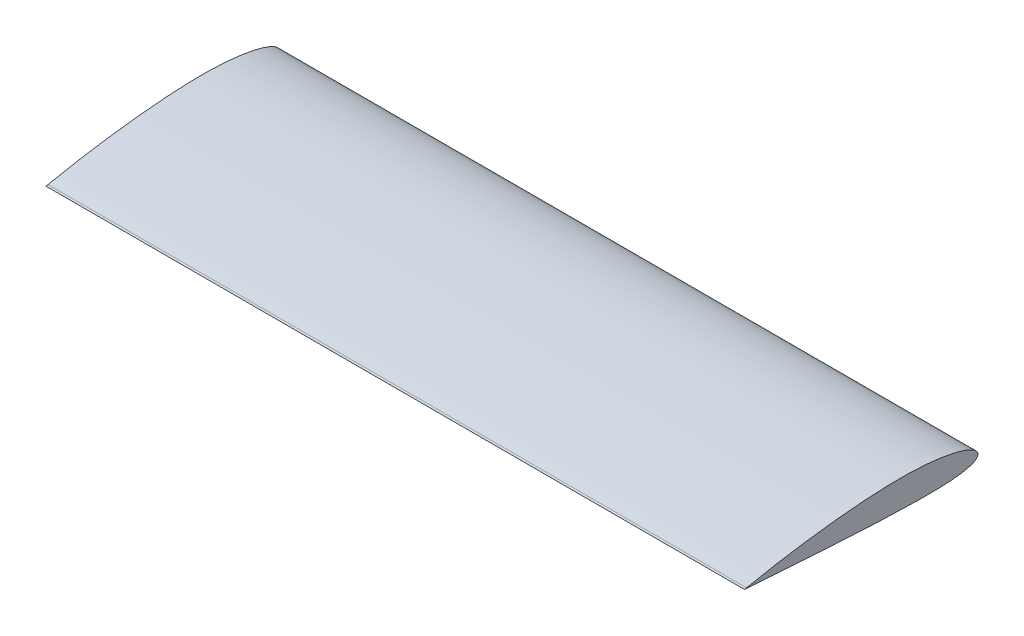
ISO-10303-21;
HEADER;
FILE_DESCRIPTION(('STEP AP214'),'2;1');
FILE_NAME('part.step','',(''),(''),'','','');
FILE_SCHEMA(('AUTOMOTIVE_DESIGN { 1 0 10303 214 1 1 1 1 }'));
ENDSEC;
DATA;
#1=APPLICATION_CONTEXT('core data for automotive mechanical design processes');
#2=APPLICATION_PROTOCOL_DEFINITION('international standard','automotive_design',2000,#1);
#3=PRODUCT_CONTEXT('',#1,'mechanical');
#4=PRODUCT('Part','Part','',(#3));
#5=PRODUCT_RELATED_PRODUCT_CATEGORY('part','',(#4));
#6=PRODUCT_DEFINITION_FORMATION('','',#4);
#7=PRODUCT_DEFINITION_CONTEXT('part definition',#1,'design');
#8=PRODUCT_DEFINITION('design','',#6,#7);
#9=PRODUCT_DEFINITION_SHAPE('','',#8);
#10=(LENGTH_UNIT() NAMED_UNIT(*) SI_UNIT(.MILLI.,.METRE.));
#11=(NAMED_UNIT(*) PLANE_ANGLE_UNIT() SI_UNIT($,.RADIAN.));
#12=(NAMED_UNIT(*) SI_UNIT($,.STERADIAN.) SOLID_ANGLE_UNIT());
#13=UNCERTAINTY_MEASURE_WITH_UNIT(LENGTH_MEASURE(1.E-05),#10,'distance_accuracy_value','');
#14=(GEOMETRIC_REPRESENTATION_CONTEXT(3) GLOBAL_UNCERTAINTY_ASSIGNED_CONTEXT((#13)) GLOBAL_UNIT_ASSIGNED_CONTEXT((#10,
#11,#12)) REPRESENTATION_CONTEXT('',''));
#15=CARTESIAN_POINT('',(0.,0.,0.));
#16=DIRECTION('',(0.,0.,1.));
#17=DIRECTION('',(1.,0.,0.));
#18=AXIS2_PLACEMENT_3D('',#15,#16,#17);
#19=CARTESIAN_POINT('',(400.,-0.333105,264.97774));
#20=CARTESIAN_POINT('',(400.,-0.343086398439484,264.840381647581));
#21=CARTESIAN_POINT('',(400.,-0.382954061590913,264.291745446105));
#22=CARTESIAN_POINT('',(400.,-0.472447332258964,263.060588227852));
#23=CARTESIAN_POINT('',(400.,-0.619491603057295,261.017524089221));
#24=CARTESIAN_POINT('',(400.,-0.823254103332756,258.175971421427));
#25=CARTESIAN_POINT('',(400.,-1.08035983504779,254.554402567837));
#26=CARTESIAN_POINT('',(400.,-1.38873604157051,250.176374286789));
#27=CARTESIAN_POINT('',(400.,-1.74457803952383,245.070197097375));
#28=CARTESIAN_POINT('',(400.,-2.14448461237748,239.268728847541));
#29=CARTESIAN_POINT('',(400.,-2.5855760887511,232.809108357549));
#30=CARTESIAN_POINT('',(400.,-3.06363750042959,225.732617470253));
#31=CARTESIAN_POINT('',(400.,-3.57628691586201,218.08421906913));
#32=CARTESIAN_POINT('',(400.,-4.11840500560355,209.912313524899));
#33=CARTESIAN_POINT('',(400.,-4.68710830231964,201.268312633106));
#34=CARTESIAN_POINT('',(400.,-5.27716928180779,192.206498450347));
#35=CARTESIAN_POINT('',(400.,-5.88359412654541,182.783440417792));
#36=CARTESIAN_POINT('',(400.,-6.49988718754895,173.057713444675));
#37=CARTESIAN_POINT('',(400.,-7.11737459374632,163.089417583912));
#38=CARTESIAN_POINT('',(400.,-7.7281453660474,152.940024856377));
#39=CARTESIAN_POINT('',(400.,-8.32027508678526,142.671807574428));
#40=CARTESIAN_POINT('',(400.,-8.88299758938067,132.347464274168));
#41=CARTESIAN_POINT('',(400.,-9.40032389772018,122.029645296017));
#42=CARTESIAN_POINT('',(400.,-9.86098005029763,111.792756576857));
#43=CARTESIAN_POINT('',(400.,-10.2419084070734,101.713695699793));
#44=CARTESIAN_POINT('',(400.,-10.5897344976678,91.8544705413589));
#45=CARTESIAN_POINT('',(400.,-10.8801771942521,82.2599682068506));
#46=CARTESIAN_POINT('',(400.,-11.0979325902701,72.969697841113));
#47=CARTESIAN_POINT('',(400.,-11.2241010109014,64.036529176303));
#48=CARTESIAN_POINT('',(400.,-11.2433112582234,55.5113403962553));
#49=CARTESIAN_POINT('',(400.,-11.1403210932851,47.442938193976));
#50=CARTESIAN_POINT('',(400.,-10.9039511396428,39.8777778541888));
#51=CARTESIAN_POINT('',(400.,-10.5243541578148,32.8599574526275));
#52=CARTESIAN_POINT('',(400.,-9.99547629959962,26.430792204349));
#53=CARTESIAN_POINT('',(400.,-9.31285336830411,20.6286265865943));
#54=CARTESIAN_POINT('',(400.,-8.47538916462038,15.4882661550534));
#55=CARTESIAN_POINT('',(400.,-7.48383595514868,11.0399606438756));
#56=CARTESIAN_POINT('',(400.,-6.34071510158632,7.30803135455585));
#57=CARTESIAN_POINT('',(400.,-5.0447380819559,4.30810264299736));
#58=CARTESIAN_POINT('',(400.,-3.58928961311949,2.04519397034396));
#59=CARTESIAN_POINT('',(400.,-1.9270787651214,0.520044605673095));
#60=CARTESIAN_POINT('',(400.,-0.015132606937662,-0.151086197310095));
#61=CARTESIAN_POINT('',(400.,1.99369453815204,0.12866351689015));
#62=CARTESIAN_POINT('',(400.,3.92547996049618,1.30692101404902));
#63=CARTESIAN_POINT('',(400.,5.79370516037481,3.26474907590773));
#64=CARTESIAN_POINT('',(400.,7.6355176023044,6.00088538468052));
#65=CARTESIAN_POINT('',(400.,9.44707375809193,9.51377246260984));
#66=CARTESIAN_POINT('',(400.,11.2103918098742,13.794651418626));
#67=CARTESIAN_POINT('',(400.,12.9020007520039,18.8235611140945));
#68=CARTESIAN_POINT('',(400.,14.4950294512341,24.5739152595655));
#69=CARTESIAN_POINT('',(400.,15.9648751202824,31.0116820652048));
#70=CARTESIAN_POINT('',(400.,17.2851916032288,38.0979977685286));
#71=CARTESIAN_POINT('',(400.,18.4335908906827,45.7880268577529));
#72=CARTESIAN_POINT('',(400.,19.3897528805995,54.0324642520899));
#73=CARTESIAN_POINT('',(400.,20.1376284632721,62.77743029114));
#74=CARTESIAN_POINT('',(400.,20.6640622359932,71.9655504369099));
#75=CARTESIAN_POINT('',(400.,20.9612263954031,81.5360467910961));
#76=CARTESIAN_POINT('',(400.,21.0255218281817,91.4256556207248));
#77=CARTESIAN_POINT('',(400.,20.8584306033123,101.553936183397));
#78=CARTESIAN_POINT('',(400.,20.4612710614624,111.842174889108));
#79=CARTESIAN_POINT('',(400.,19.9070899485495,122.22699254535));
#80=CARTESIAN_POINT('',(400.,19.2030866162824,132.658565599283));
#81=CARTESIAN_POINT('',(400.,18.3659116600995,143.083389013939));
#82=CARTESIAN_POINT('',(400.,17.4092482431578,153.436223744034));
#83=CARTESIAN_POINT('',(400.,16.3524050329091,163.652758488645));
#84=CARTESIAN_POINT('',(400.,15.2107450277969,173.669610490618));
#85=CARTESIAN_POINT('',(400.,14.0042483036042,183.425101928762));
#86=CARTESIAN_POINT('',(400.,12.7501718959421,192.859315617433));
#87=CARTESIAN_POINT('',(400.,11.4670714452023,201.914571502478));
#88=CARTESIAN_POINT('',(400.,10.174181336886,210.535821315948));
#89=CARTESIAN_POINT('',(400.,8.89006976354393,218.670630041925));
#90=CARTESIAN_POINT('',(400.,7.63362981541927,226.26995729515));
#91=CARTESIAN_POINT('',(400.,6.42419688318019,233.288212254772));
#92=CARTESIAN_POINT('',(400.,5.28007664225557,239.683580204607));
#93=CARTESIAN_POINT('',(400.,4.21908710505265,245.417849168806));
#94=CARTESIAN_POINT('',(400.,3.25928961884847,250.457262183279));
#95=CARTESIAN_POINT('',(400.,2.41628190967542,254.772148360217));
#96=CARTESIAN_POINT('',(400.,1.70460781413092,258.337172417303));
#97=CARTESIAN_POINT('',(400.,1.13752635519061,261.131749999981));
#98=CARTESIAN_POINT('',(400.,0.724422493665584,263.139373936522));
#99=CARTESIAN_POINT('',(400.,0.473436401806954,264.348608843345));
#100=CARTESIAN_POINT('',(400.,0.361203166653233,264.887376700738));
#101=CARTESIAN_POINT('',(400.,0.333105,265.02226));
#102=B_SPLINE_CURVE_WITH_KNOTS('',3,(#19,#20,#21,#22,#23,#24,#25,#26,#27,#28,#29,#30,#31,#32,
#33,#34,#35,#36,#37,#38,#39,#40,#41,#42,#43,#44,#45,#46,#47,#48,#49,#50,#51,#52,#53,#54,#55,#56,
#57,#58,#59,#60,#61,#62,#63,#64,#65,#66,#67,#68,#69,#70,#71,#72,#73,#74,#75,#76,#77,#78,#79,#80,
#81,#82,#83,#84,#85,#86,#87,#88,#89,#90,#91,#92,#93,#94,#95,#96,#97,#98,#99,#100,#101),
.UNSPECIFIED.,.F.,.F.,(4,1,1,1,1,1,1,1,1,1,1,1,1,1,1,1,1,1,1,1,1,1,1,1,1,1,1,1,1,1,1,1,1,1,1,1,
1,1,1,1,1,1,1,1,1,1,1,1,1,1,1,1,1,1,1,1,1,1,1,1,1,1,1,1,1,1,1,1,1,1,1,1,1,1,1,1,1,1,1,1,4),(0.,
0.000763849001500838,0.00305096273583516,0.0068464695522461,0.0121247484862886,
0.0188517323013395,0.0269835822459313,0.036467072952227,0.0472411623624427,0.059237023749269,
0.072377943954829,0.0865794557279205,0.101753050357609,0.117801975084679,0.134625927408029,
0.15211965624753,0.170173849863638,0.188676584211923,0.207513463209848,0.226567927798734,
0.245722459831779,0.264860936987902,0.283866077458523,0.302557043653414,0.320802791746689,
0.338582940766319,0.355795759860566,0.372343677759343,0.388133630608251,0.403078328240631,
0.417095611775281,0.430110357882856,0.442054549095498,0.452868818715277,0.462505009146628,
0.470928785019175,0.478127761278921,0.484123875338212,0.488999972182062,0.492959403174825,
0.496412777697822,0.499866609506216,0.50383217608047,0.508732461778435,0.51477966167091,
0.522066384116654,0.530620554720803,0.540434572011856,0.551477175550533,0.563701851231184,
0.577048547245343,0.591447280896427,0.606818147252312,0.623074182281721,0.640120289431202,
0.657856183183399,0.676175563379063,0.694967819833854,0.714033957187982,0.733277175195403,
0.752646098718606,0.772021105338392,0.7912817902148,0.810310109979621,0.828987081513378,
0.847197702829786,0.864829110746378,0.881772296963255,0.897922602456206,0.913179947694549,
0.927449194878037,0.940643128994877,0.952679251989813,0.963483187916785,0.972987160696187,
0.981132008479951,0.987867526601434,0.993150194295179,0.996947646215246,0.999235827558466,1.),.UNSPECIFIED.);
#103=DIRECTION('',(-1.,0.,0.));
#104=VECTOR('',#103,1.);
#105=SURFACE_OF_LINEAR_EXTRUSION('',#102,#104);
#106=CARTESIAN_POINT('',(-400.,-0.333105,264.97774));
#107=CARTESIAN_POINT('',(-400.,-0.343086398439484,264.840381647581));
#108=CARTESIAN_POINT('',(-400.,-0.382954061590913,264.291745446105));
#109=CARTESIAN_POINT('',(-400.,-0.472447332258964,263.060588227852));
#110=CARTESIAN_POINT('',(-400.,-0.619491603057295,261.017524089221));
#111=CARTESIAN_POINT('',(-400.,-0.823254103332756,258.175971421427));
#112=CARTESIAN_POINT('',(-400.,-1.08035983504779,254.554402567837));
#113=CARTESIAN_POINT('',(-400.,-1.38873604157051,250.176374286789));
#114=CARTESIAN_POINT('',(-400.,-1.74457803952383,245.070197097375));
#115=CARTESIAN_POINT('',(-400.,-2.14448461237748,239.268728847541));
#116=CARTESIAN_POINT('',(-400.,-2.5855760887511,232.809108357549));
#117=CARTESIAN_POINT('',(-400.,-3.06363750042959,225.732617470253));
#118=CARTESIAN_POINT('',(-400.,-3.57628691586201,218.08421906913));
#119=CARTESIAN_POINT('',(-400.,-4.11840500560355,209.912313524899));
#120=CARTESIAN_POINT('',(-400.,-4.68710830231964,201.268312633106));
#121=CARTESIAN_POINT('',(-400.,-5.27716928180779,192.206498450347));
#122=CARTESIAN_POINT('',(-400.,-5.88359412654541,182.783440417792));
#123=CARTESIAN_POINT('',(-400.,-6.49988718754895,173.057713444675));
#124=CARTESIAN_POINT('',(-400.,-7.11737459374632,163.089417583912));
#125=CARTESIAN_POINT('',(-400.,-7.7281453660474,152.940024856377));
#126=CARTESIAN_POINT('',(-400.,-8.32027508678526,142.671807574428));
#127=CARTESIAN_POINT('',(-400.,-8.88299758938067,132.347464274168));
#128=CARTESIAN_POINT('',(-400.,-9.40032389772018,122.029645296017));
#129=CARTESIAN_POINT('',(-400.,-9.86098005029763,111.792756576857));
#130=CARTESIAN_POINT('',(-400.,-10.2419084070734,101.713695699793));
#131=CARTESIAN_POINT('',(-400.,-10.5897344976678,91.8544705413589));
#132=CARTESIAN_POINT('',(-400.,-10.8801771942521,82.2599682068506));
#133=CARTESIAN_POINT('',(-400.,-11.0979325902701,72.969697841113));
#134=CARTESIAN_POINT('',(-400.,-11.2241010109014,64.036529176303));
#135=CARTESIAN_POINT('',(-400.,-11.2433112582234,55.5113403962553));
#136=CARTESIAN_POINT('',(-400.,-11.1403210932851,47.442938193976));
#137=CARTESIAN_POINT('',(-400.,-10.9039511396428,39.8777778541888));
#138=CARTESIAN_POINT('',(-400.,-10.5243541578148,32.8599574526275));
#139=CARTESIAN_POINT('',(-400.,-9.99547629959962,26.430792204349));
#140=CARTESIAN_POINT('',(-400.,-9.31285336830411,20.6286265865943));
#141=CARTESIAN_POINT('',(-400.,-8.47538916462038,15.4882661550534));
#142=CARTESIAN_POINT('',(-400.,-7.48383595514868,11.0399606438756));
#143=CARTESIAN_POINT('',(-400.,-6.34071510158632,7.30803135455585));
#144=CARTESIAN_POINT('',(-400.,-5.0447380819559,4.30810264299736));
#145=CARTESIAN_POINT('',(-400.,-3.58928961311949,2.04519397034396));
#146=CARTESIAN_POINT('',(-400.,-1.9270787651214,0.520044605673095));
#147=CARTESIAN_POINT('',(-400.,-0.015132606937662,-0.151086197310095));
#148=CARTESIAN_POINT('',(-400.,1.99369453815204,0.12866351689015));
#149=CARTESIAN_POINT('',(-400.,3.92547996049618,1.30692101404902));
#150=CARTESIAN_POINT('',(-400.,5.79370516037481,3.26474907590773));
#151=CARTESIAN_POINT('',(-400.,7.6355176023044,6.00088538468052));
#152=CARTESIAN_POINT('',(-400.,9.44707375809193,9.51377246260984));
#153=CARTESIAN_POINT('',(-400.,11.2103918098742,13.794651418626));
#154=CARTESIAN_POINT('',(-400.,12.9020007520039,18.8235611140945));
#155=CARTESIAN_POINT('',(-400.,14.4950294512341,24.5739152595655));
#156=CARTESIAN_POINT('',(-400.,15.9648751202824,31.0116820652048));
#157=CARTESIAN_POINT('',(-400.,17.2851916032288,38.0979977685286));
#158=CARTESIAN_POINT('',(-400.,18.4335908906827,45.7880268577529));
#159=CARTESIAN_POINT('',(-400.,19.3897528805995,54.0324642520899));
#160=CARTESIAN_POINT('',(-400.,20.1376284632721,62.77743029114));
#161=CARTESIAN_POINT('',(-400.,20.6640622359932,71.9655504369099));
#162=CARTESIAN_POINT('',(-400.,20.9612263954031,81.5360467910961));
#163=CARTESIAN_POINT('',(-400.,21.0255218281817,91.4256556207248));
#164=CARTESIAN_POINT('',(-400.,20.8584306033123,101.553936183397));
#165=CARTESIAN_POINT('',(-400.,20.4612710614624,111.842174889108));
#166=CARTESIAN_POINT('',(-400.,19.9070899485495,122.22699254535));
#167=CARTESIAN_POINT('',(-400.,19.2030866162824,132.658565599283));
#168=CARTESIAN_POINT('',(-400.,18.3659116600995,143.083389013939));
#169=CARTESIAN_POINT('',(-400.,17.4092482431578,153.436223744034));
#170=CARTESIAN_POINT('',(-400.,16.3524050329091,163.652758488645));
#171=CARTESIAN_POINT('',(-400.,15.2107450277969,173.669610490618));
#172=CARTESIAN_POINT('',(-400.,14.0042483036042,183.425101928762));
#173=CARTESIAN_POINT('',(-400.,12.7501718959421,192.859315617433));
#174=CARTESIAN_POINT('',(-400.,11.4670714452023,201.914571502478));
#175=CARTESIAN_POINT('',(-400.,10.174181336886,210.535821315948));
#176=CARTESIAN_POINT('',(-400.,8.89006976354393,218.670630041925));
#177=CARTESIAN_POINT('',(-400.,7.63362981541927,226.26995729515));
#178=CARTESIAN_POINT('',(-400.,6.42419688318019,233.288212254772));
#179=CARTESIAN_POINT('',(-400.,5.28007664225557,239.683580204607));
#180=CARTESIAN_POINT('',(-400.,4.21908710505265,245.417849168806));
#181=CARTESIAN_POINT('',(-400.,3.25928961884847,250.457262183279));
#182=CARTESIAN_POINT('',(-400.,2.41628190967542,254.772148360217));
#183=CARTESIAN_POINT('',(-400.,1.70460781413092,258.337172417303));
#184=CARTESIAN_POINT('',(-400.,1.13752635519061,261.131749999981));
#185=CARTESIAN_POINT('',(-400.,0.724422493665584,263.139373936522));
#186=CARTESIAN_POINT('',(-400.,0.473436401806954,264.348608843345));
#187=CARTESIAN_POINT('',(-400.,0.361203166653233,264.887376700738));
#188=CARTESIAN_POINT('',(-400.,0.333105,265.02226));
#189=B_SPLINE_CURVE_WITH_KNOTS('',3,(#106,#107,#108,#109,#110,#111,#112,#113,#114,#115,#116,
#117,#118,#119,#120,#121,#122,#123,#124,#125,#126,#127,#128,#129,#130,#131,#132,#133,#134,#135,
#136,#137,#138,#139,#140,#141,#142,#143,#144,#145,#146,#147,#148,#149,#150,#151,#152,#153,#154,
#155,#156,#157,#158,#159,#160,#161,#162,#163,#164,#165,#166,#167,#168,#169,#170,#171,#172,#173,
#174,#175,#176,#177,#178,#179,#180,#181,#182,#183,#184,#185,#186,#187,#188),.UNSPECIFIED.,.F.,
.F.,(4,1,1,1,1,1,1,1,1,1,1,1,1,1,1,1,1,1,1,1,1,1,1,1,1,1,1,1,1,1,1,1,1,1,1,1,1,1,1,1,1,1,1,1,1,
1,1,1,1,1,1,1,1,1,1,1,1,1,1,1,1,1,1,1,1,1,1,1,1,1,1,1,1,1,1,1,1,1,1,1,4),(0.,
0.000763849001500838,0.00305096273583516,0.0068464695522461,0.0121247484862886,
0.0188517323013395,0.0269835822459313,0.036467072952227,0.0472411623624427,0.059237023749269,
0.072377943954829,0.0865794557279205,0.101753050357609,0.117801975084679,0.134625927408029,
0.15211965624753,0.170173849863638,0.188676584211923,0.207513463209848,0.226567927798734,
0.245722459831779,0.264860936987902,0.283866077458523,0.302557043653414,0.320802791746689,
0.338582940766319,0.355795759860566,0.372343677759343,0.388133630608251,0.403078328240631,
0.417095611775281,0.430110357882856,0.442054549095498,0.452868818715277,0.462505009146628,
0.470928785019175,0.478127761278921,0.484123875338212,0.488999972182062,0.492959403174825,
0.496412777697822,0.499866609506216,0.50383217608047,0.508732461778435,0.51477966167091,
0.522066384116654,0.530620554720803,0.540434572011856,0.551477175550533,0.563701851231184,
0.577048547245343,0.591447280896427,0.606818147252312,0.623074182281721,0.640120289431202,
0.657856183183399,0.676175563379063,0.694967819833854,0.714033957187982,0.733277175195403,
0.752646098718606,0.772021105338392,0.7912817902148,0.810310109979621,0.828987081513378,
0.847197702829786,0.864829110746378,0.881772296963255,0.897922602456206,0.913179947694549,
0.927449194878037,0.940643128994877,0.952679251989813,0.963483187916785,0.972987160696187,
0.981132008479951,0.987867526601434,0.993150194295179,0.996947646215246,0.999235827558466,1.),.UNSPECIFIED.);
#190=CARTESIAN_POINT('',(-400.,-0.333105,264.97774));
#191=VERTEX_POINT('',#190);
#192=CARTESIAN_POINT('',(-400.,0.333105,265.02226));
#193=VERTEX_POINT('',#192);
#194=EDGE_CURVE('E95',#191,#193,#189,.T.);
#195=ORIENTED_EDGE('',*,*,#194,.T.);
#196=DIRECTION('',(-1.,0.,0.));
#197=VECTOR('',#196,1.);
#198=CARTESIAN_POINT('',(400.,0.333105,265.02226));
#199=LINE('',#198,#197);
#200=CARTESIAN_POINT('',(400.,0.333105,265.02226));
#201=VERTEX_POINT('',#200);
#202=EDGE_CURVE('E11',#201,#193,#199,.T.);
#203=ORIENTED_EDGE('',*,*,#202,.F.);
#204=CARTESIAN_POINT('',(400.,-0.333105,264.97774));
#205=VERTEX_POINT('',#204);
#206=EDGE_CURVE('E88',#205,#201,#102,.T.);
#207=ORIENTED_EDGE('',*,*,#206,.F.);
#208=DIRECTION('',(-1.,0.,0.));
#209=VECTOR('',#208,1.);
#210=CARTESIAN_POINT('',(400.,-0.333105,264.97774));
#211=LINE('',#210,#209);
#212=EDGE_CURVE('E96',#205,#191,#211,.T.);
#213=ORIENTED_EDGE('',*,*,#212,.T.);
#214=EDGE_LOOP('',(#195,#203,#207,#213));
#215=FACE_BOUND('',#214,.T.);
#216=ADVANCED_FACE('F45',(#215),#105,.F.);
#217=CARTESIAN_POINT('',(400.,0.333105,265.02226));
#218=DIRECTION('',(0.,-0.978984072534484,-0.203936719900552));
#219=DIRECTION('',(0.,0.203936719900552,-0.978984072534484));
#220=AXIS2_PLACEMENT_3D('',#217,#218,#219);
#221=PLANE('',#220);
#222=DIRECTION('',(0.,-0.203936719900552,0.978984072534484));
#223=VECTOR('',#222,1.);
#224=CARTESIAN_POINT('',(-400.,0.333105,265.02226));
#225=LINE('',#224,#223);
#226=CARTESIAN_POINT('',(-400.,-0.158412693785815,267.381756582174));
#227=VERTEX_POINT('',#226);
#228=EDGE_CURVE('E75',#193,#227,#225,.T.);
#229=ORIENTED_EDGE('',*,*,#228,.T.);
#230=DIRECTION('',(-1.,0.,0.));
#231=VECTOR('',#230,1.);
#232=CARTESIAN_POINT('',(400.,-0.158412693785815,267.381756582174));
#233=LINE('',#232,#231);
#234=CARTESIAN_POINT('',(400.,-0.158412693785815,267.381756582174));
#235=VERTEX_POINT('',#234);
#236=EDGE_CURVE('E55',#235,#227,#233,.T.);
#237=ORIENTED_EDGE('',*,*,#236,.F.);
#238=DIRECTION('',(0.,-0.203936719900552,0.978984072534484));
#239=VECTOR('',#238,1.);
#240=CARTESIAN_POINT('',(400.,0.333105,265.02226));
#241=LINE('',#240,#239);
#242=EDGE_CURVE('E83',#201,#235,#241,.T.);
#243=ORIENTED_EDGE('',*,*,#242,.F.);
#244=ORIENTED_EDGE('',*,*,#202,.T.);
#245=EDGE_LOOP('',(#229,#237,#243,#244));
#246=FACE_BOUND('',#245,.T.);
#247=ADVANCED_FACE('F84',(#246),#221,.F.);
#248=CARTESIAN_POINT('',(400.,-0.333105,264.97774));
#249=DIRECTION('',(0.,0.997370175105789,-0.0724757463531665));
#250=DIRECTION('',(0.,0.0724757463531665,0.997370175105789));
#251=AXIS2_PLACEMENT_3D('',#248,#249,#250);
#252=PLANE('',#251);
#253=DIRECTION('',(0.,-0.0724757463531665,-0.997370175105789));
#254=VECTOR('',#253,1.);
#255=CARTESIAN_POINT('',(-400.,-0.333105,264.97774));
#256=LINE('',#255,#254);
#257=EDGE_CURVE('E80',#227,#191,#256,.T.);
#258=ORIENTED_EDGE('',*,*,#257,.T.);
#259=ORIENTED_EDGE('',*,*,#212,.F.);
#260=DIRECTION('',(0.,-0.0724757463531665,-0.997370175105789));
#261=VECTOR('',#260,1.);
#262=CARTESIAN_POINT('',(400.,-0.333105,264.97774));
#263=LINE('',#262,#261);
#264=EDGE_CURVE('E63',#235,#205,#263,.T.);
#265=ORIENTED_EDGE('',*,*,#264,.F.);
#266=ORIENTED_EDGE('',*,*,#236,.T.);
#267=EDGE_LOOP('',(#258,#259,#265,#266));
#268=FACE_BOUND('',#267,.T.);
#269=ADVANCED_FACE('F113',(#268),#252,.F.);
#270=CARTESIAN_POINT('',(400.,1.92273153726772,0.251719272612008));
#271=DIRECTION('',(1.,0.,0.));
#272=DIRECTION('',(0.,0.,-1.));
#273=AXIS2_PLACEMENT_3D('',#270,#271,#272);
#274=PLANE('',#273);
#275=ORIENTED_EDGE('',*,*,#206,.T.);
#276=ORIENTED_EDGE('',*,*,#242,.T.);
#277=ORIENTED_EDGE('',*,*,#264,.T.);
#278=EDGE_LOOP('',(#275,#276,#277));
#279=FACE_BOUND('',#278,.T.);
#280=ADVANCED_FACE('F91',(#279),#274,.T.);
#281=CARTESIAN_POINT('',(-400.,1.92273153726772,0.251719272612008));
#282=DIRECTION('',(1.,0.,0.));
#283=DIRECTION('',(0.,0.,-1.));
#284=AXIS2_PLACEMENT_3D('',#281,#282,#283);
#285=PLANE('',#284);
#286=ORIENTED_EDGE('',*,*,#194,.F.);
#287=ORIENTED_EDGE('',*,*,#257,.F.);
#288=ORIENTED_EDGE('',*,*,#228,.F.);
#289=EDGE_LOOP('',(#286,#287,#288));
#290=FACE_BOUND('',#289,.T.);
#291=ADVANCED_FACE('F114',(#290),#285,.F.);
#292=CLOSED_SHELL('',(#216,#247,#269,#280,#291));
#293=MANIFOLD_SOLID_BREP('B2',#292);
#294=ADVANCED_BREP_SHAPE_REPRESENTATION('',(#18,#293),#14);
#295=SHAPE_DEFINITION_REPRESENTATION(#9,#294);
ENDSEC;
END-ISO-10303-21;
